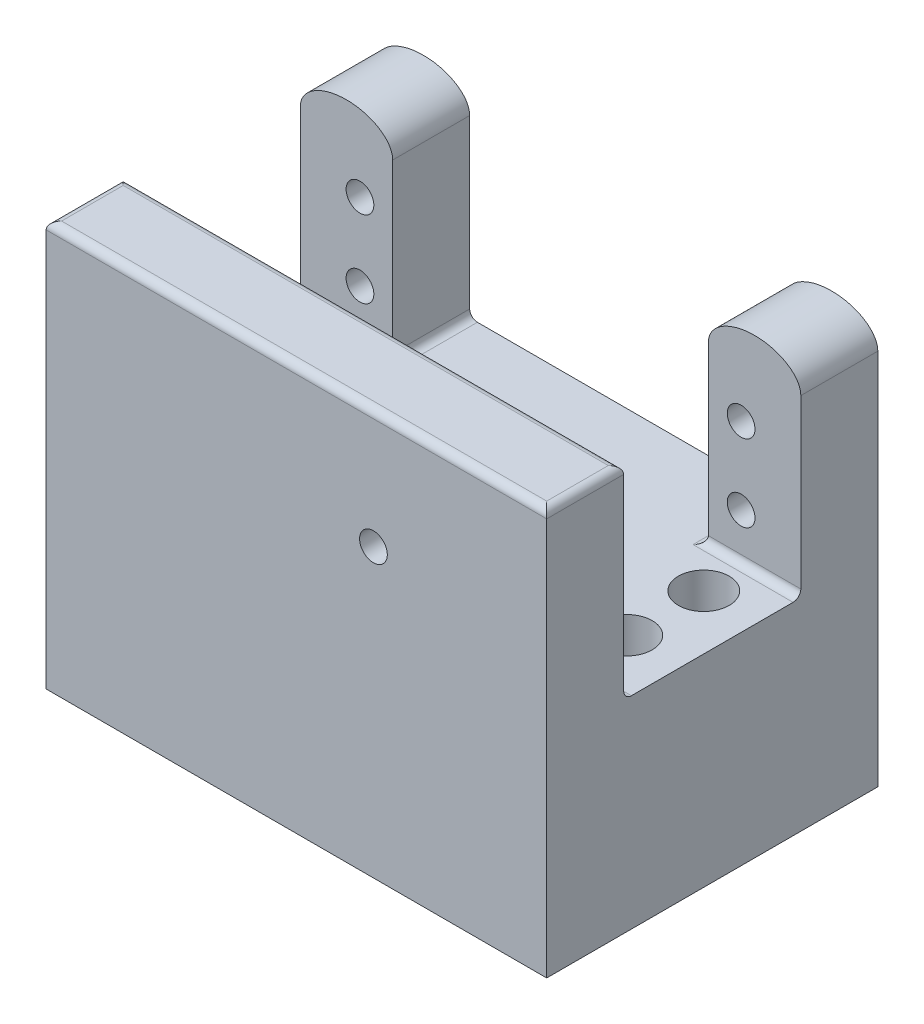
ISO-10303-21;
HEADER;
FILE_DESCRIPTION(('STEP AP214'),'2;1');
FILE_NAME('part.step','',(''),(''),'','','');
FILE_SCHEMA(('AUTOMOTIVE_DESIGN { 1 0 10303 214 1 1 1 1 }'));
ENDSEC;
DATA;
#1=APPLICATION_CONTEXT('core data for automotive mechanical design processes');
#2=APPLICATION_PROTOCOL_DEFINITION('international standard','automotive_design',2000,#1);
#3=PRODUCT_CONTEXT('',#1,'mechanical');
#4=PRODUCT('Part','Part','',(#3));
#5=PRODUCT_RELATED_PRODUCT_CATEGORY('part','',(#4));
#6=PRODUCT_DEFINITION_FORMATION('','',#4);
#7=PRODUCT_DEFINITION_CONTEXT('part definition',#1,'design');
#8=PRODUCT_DEFINITION('design','',#6,#7);
#9=PRODUCT_DEFINITION_SHAPE('','',#8);
#10=(LENGTH_UNIT() NAMED_UNIT(*) SI_UNIT(.MILLI.,.METRE.));
#11=(NAMED_UNIT(*) PLANE_ANGLE_UNIT() SI_UNIT($,.RADIAN.));
#12=(NAMED_UNIT(*) SI_UNIT($,.STERADIAN.) SOLID_ANGLE_UNIT());
#13=UNCERTAINTY_MEASURE_WITH_UNIT(LENGTH_MEASURE(1.E-05),#10,'distance_accuracy_value','');
#14=(GEOMETRIC_REPRESENTATION_CONTEXT(3) GLOBAL_UNCERTAINTY_ASSIGNED_CONTEXT((#13)) GLOBAL_UNIT_ASSIGNED_CONTEXT((#10,
#11,#12)) REPRESENTATION_CONTEXT('',''));
#15=CARTESIAN_POINT('',(0.,0.,0.));
#16=DIRECTION('',(0.,0.,1.));
#17=DIRECTION('',(1.,0.,0.));
#18=AXIS2_PLACEMENT_3D('',#15,#16,#17);
#19=CARTESIAN_POINT('',(0.,0.,33.));
#20=DIRECTION('',(0.,0.,1.));
#21=DIRECTION('',(1.,0.,0.));
#22=AXIS2_PLACEMENT_3D('',#19,#20,#21);
#23=PLANE('',#22);
#24=CARTESIAN_POINT('',(-16.5,2.55301226726425,33.));
#25=DIRECTION('',(0.,0.,1.));
#26=DIRECTION('',(1.,0.,0.));
#27=AXIS2_PLACEMENT_3D('',#24,#25,#26);
#28=CIRCLE('',#27,1.79999999999999);
#29=CARTESIAN_POINT('',(-14.7,2.55301226726425,33.));
#30=VERTEX_POINT('',#29);
#31=EDGE_CURVE('E404',#30,#30,#28,.T.);
#32=ORIENTED_EDGE('',*,*,#31,.T.);
#33=EDGE_LOOP('',(#32));
#34=FACE_BOUND('',#33,.T.);
#35=DIRECTION('',(0.,-1.,0.));
#36=VECTOR('',#35,1.);
#37=CARTESIAN_POINT('',(-59.,-20.6976744186047,33.));
#38=LINE('',#37,#36);
#39=CARTESIAN_POINT('',(-59.,16.9392946847438,33.));
#40=VERTEX_POINT('',#39);
#41=CARTESIAN_POINT('',(-59.,-7.44767441860465,33.));
#42=VERTEX_POINT('',#41);
#43=EDGE_CURVE('E419',#40,#42,#38,.T.);
#44=ORIENTED_EDGE('',*,*,#43,.F.);
#45=DIRECTION('',(-1.,0.,0.));
#46=VECTOR('',#45,1.);
#47=CARTESIAN_POINT('',(0.,16.9392946847438,33.));
#48=LINE('',#47,#46);
#49=CARTESIAN_POINT('',(6.00000000000001,16.9392946847438,33.));
#50=VERTEX_POINT('',#49);
#51=EDGE_CURVE('E330',#40,#50,#48,.F.);
#52=ORIENTED_EDGE('',*,*,#51,.T.);
#53=DIRECTION('',(0.,1.,0.));
#54=VECTOR('',#53,1.);
#55=CARTESIAN_POINT('',(6.00000000000001,-20.6976744186046,33.));
#56=LINE('',#55,#54);
#57=CARTESIAN_POINT('',(6.00000000000001,-7.44767441860465,33.));
#58=VERTEX_POINT('',#57);
#59=EDGE_CURVE('E441',#58,#50,#56,.T.);
#60=ORIENTED_EDGE('',*,*,#59,.F.);
#61=DIRECTION('',(1.,0.,0.));
#62=VECTOR('',#61,1.);
#63=CARTESIAN_POINT('',(0.,-7.44767441860465,33.));
#64=LINE('',#63,#62);
#65=EDGE_CURVE('E328',#58,#42,#64,.F.);
#66=ORIENTED_EDGE('',*,*,#65,.T.);
#67=EDGE_LOOP('',(#44,#52,#60,#66));
#68=FACE_BOUND('',#67,.T.);
#69=ADVANCED_FACE('F40',(#34,#68),#23,.F.);
#70=CARTESIAN_POINT('',(-6.,14.3023255813954,10.));
#71=DIRECTION('',(1.,0.,0.));
#72=DIRECTION('',(0.,1.,0.));
#73=AXIS2_PLACEMENT_3D('',#70,#71,#72);
#74=PLANE('',#73);
#75=DIRECTION('',(0.,-1.,0.));
#76=VECTOR('',#75,1.);
#77=CARTESIAN_POINT('',(-6.,14.3023255813954,0.));
#78=LINE('',#77,#76);
#79=CARTESIAN_POINT('',(-6.,14.3023255813954,0.));
#80=VERTEX_POINT('',#79);
#81=CARTESIAN_POINT('',(-6.,-7.44767441860465,0.));
#82=VERTEX_POINT('',#81);
#83=EDGE_CURVE('E308',#80,#82,#78,.T.);
#84=ORIENTED_EDGE('',*,*,#83,.T.);
#85=DIRECTION('',(0.,0.,1.));
#86=VECTOR('',#85,1.);
#87=CARTESIAN_POINT('',(-6.,-7.44767441860465,10.));
#88=LINE('',#87,#86);
#89=CARTESIAN_POINT('',(-6.,-7.44767441860465,10.));
#90=VERTEX_POINT('',#89);
#91=EDGE_CURVE('E353',#82,#90,#88,.T.);
#92=ORIENTED_EDGE('',*,*,#91,.T.);
#93=DIRECTION('',(0.,-1.,0.));
#94=VECTOR('',#93,1.);
#95=CARTESIAN_POINT('',(-6.,14.3023255813954,10.));
#96=LINE('',#95,#94);
#97=CARTESIAN_POINT('',(-6.,14.3023255813954,10.));
#98=VERTEX_POINT('',#97);
#99=EDGE_CURVE('E297',#98,#90,#96,.T.);
#100=ORIENTED_EDGE('',*,*,#99,.F.);
#101=DIRECTION('',(0.,0.,-1.));
#102=VECTOR('',#101,1.);
#103=CARTESIAN_POINT('',(-6.,14.3023255813954,10.));
#104=LINE('',#103,#102);
#105=EDGE_CURVE('E313',#98,#80,#104,.T.);
#106=ORIENTED_EDGE('',*,*,#105,.T.);
#107=EDGE_LOOP('',(#84,#92,#100,#106));
#108=FACE_BOUND('',#107,.T.);
#109=ADVANCED_FACE('F254',(#108),#74,.F.);
#110=CARTESIAN_POINT('',(-47.,-20.6976744186046,33.));
#111=DIRECTION('',(-1.,0.,0.));
#112=DIRECTION('',(0.,0.,1.));
#113=AXIS2_PLACEMENT_3D('',#110,#111,#112);
#114=PLANE('',#113);
#115=DIRECTION('',(0.,-1.,0.));
#116=VECTOR('',#115,1.);
#117=CARTESIAN_POINT('',(-47.,14.3023255813954,10.));
#118=LINE('',#117,#116);
#119=CARTESIAN_POINT('',(-47.,14.3023255813954,10.));
#120=VERTEX_POINT('',#119);
#121=CARTESIAN_POINT('',(-47.,-7.44767441860465,10.));
#122=VERTEX_POINT('',#121);
#123=EDGE_CURVE('E493',#120,#122,#118,.T.);
#124=ORIENTED_EDGE('',*,*,#123,.T.);
#125=DIRECTION('',(0.,0.,1.));
#126=VECTOR('',#125,1.);
#127=CARTESIAN_POINT('',(-47.,-7.44767441860465,33.));
#128=LINE('',#127,#126);
#129=CARTESIAN_POINT('',(-47.,-7.44767441860465,0.));
#130=VERTEX_POINT('',#129);
#131=EDGE_CURVE('E57',#122,#130,#128,.F.);
#132=ORIENTED_EDGE('',*,*,#131,.T.);
#133=DIRECTION('',(0.,-1.,0.));
#134=VECTOR('',#133,1.);
#135=CARTESIAN_POINT('',(-47.,14.3023255813954,0.));
#136=LINE('',#135,#134);
#137=CARTESIAN_POINT('',(-47.,14.3023255813954,0.));
#138=VERTEX_POINT('',#137);
#139=EDGE_CURVE('E179',#138,#130,#136,.T.);
#140=ORIENTED_EDGE('',*,*,#139,.F.);
#141=DIRECTION('',(0.,0.,-1.));
#142=VECTOR('',#141,1.);
#143=CARTESIAN_POINT('',(-47.,14.3023255813954,10.));
#144=LINE('',#143,#142);
#145=EDGE_CURVE('E489',#120,#138,#144,.T.);
#146=ORIENTED_EDGE('',*,*,#145,.F.);
#147=EDGE_LOOP('',(#124,#132,#140,#146));
#148=FACE_BOUND('',#147,.T.);
#149=ADVANCED_FACE('F250',(#148),#114,.F.);
#150=CARTESIAN_POINT('',(0.,14.3023255813954,10.));
#151=DIRECTION('',(0.,0.,1.));
#152=DIRECTION('',(1.,0.,0.));
#153=AXIS2_PLACEMENT_3D('',#150,#151,#152);
#154=PLANE('',#153);
#155=CARTESIAN_POINT('',(-1.75,7.55218083966562,10.));
#156=DIRECTION('',(0.,0.,1.));
#157=DIRECTION('',(1.,0.,0.));
#158=AXIS2_PLACEMENT_3D('',#155,#156,#157);
#159=CIRCLE('',#158,1.8);
#160=CARTESIAN_POINT('',(0.0499999999999982,7.55218083966562,10.));
#161=VERTEX_POINT('',#160);
#162=EDGE_CURVE('E214',#161,#161,#159,.F.);
#163=ORIENTED_EDGE('',*,*,#162,.T.);
#164=EDGE_LOOP('',(#163));
#165=FACE_BOUND('',#164,.T.);
#166=CARTESIAN_POINT('',(-1.75,-2.44781916033438,10.));
#167=DIRECTION('',(0.,0.,1.));
#168=DIRECTION('',(1.,0.,0.));
#169=AXIS2_PLACEMENT_3D('',#166,#167,#168);
#170=CIRCLE('',#169,1.8);
#171=CARTESIAN_POINT('',(0.0499999999999982,-2.44781916033438,10.));
#172=VERTEX_POINT('',#171);
#173=EDGE_CURVE('E220',#172,#172,#170,.F.);
#174=ORIENTED_EDGE('',*,*,#173,.T.);
#175=EDGE_LOOP('',(#174));
#176=FACE_BOUND('',#175,.T.);
#177=ORIENTED_EDGE('',*,*,#99,.T.);
#178=DIRECTION('',(1.,0.,0.));
#179=VECTOR('',#178,1.);
#180=CARTESIAN_POINT('',(6.,-7.44767441860465,10.));
#181=LINE('',#180,#179);
#182=CARTESIAN_POINT('',(6.,-7.44767441860465,10.));
#183=VERTEX_POINT('',#182);
#184=EDGE_CURVE('E350',#90,#183,#181,.T.);
#185=ORIENTED_EDGE('',*,*,#184,.T.);
#186=DIRECTION('',(0.,1.,0.));
#187=VECTOR('',#186,1.);
#188=CARTESIAN_POINT('',(6.,14.3023255813954,10.));
#189=LINE('',#188,#187);
#190=CARTESIAN_POINT('',(6.,14.3023255813954,10.));
#191=VERTEX_POINT('',#190);
#192=EDGE_CURVE('E302',#183,#191,#189,.T.);
#193=ORIENTED_EDGE('',*,*,#192,.T.);
#194=CARTESIAN_POINT('',(0.,14.3023255813954,10.));
#195=DIRECTION('',(0.,0.,1.));
#196=DIRECTION('',(1.,0.,0.));
#197=AXIS2_PLACEMENT_3D('',#194,#195,#196);
#198=ELLIPSE('',#197,6.,3.77568003702185);
#199=EDGE_CURVE('E292',#191,#98,#198,.T.);
#200=ORIENTED_EDGE('',*,*,#199,.T.);
#201=EDGE_LOOP('',(#177,#185,#193,#200));
#202=FACE_BOUND('',#201,.T.);
#203=ADVANCED_FACE('F253',(#165,#176,#202),#154,.T.);
#204=DIRECTION('',(0.,0.,-1.));
#205=VECTOR('',#204,1.);
#206=SURFACE_OF_LINEAR_EXTRUSION('',#198,#205);
#207=CARTESIAN_POINT('',(0.,14.3023255813954,0.));
#208=DIRECTION('',(0.,0.,1.));
#209=DIRECTION('',(1.,0.,0.));
#210=AXIS2_PLACEMENT_3D('',#207,#208,#209);
#211=ELLIPSE('',#210,6.,3.77568003702185);
#212=CARTESIAN_POINT('',(6.,14.3023255813954,0.));
#213=VERTEX_POINT('',#212);
#214=EDGE_CURVE('E305',#213,#80,#211,.T.);
#215=ORIENTED_EDGE('',*,*,#214,.T.);
#216=ORIENTED_EDGE('',*,*,#105,.F.);
#217=ORIENTED_EDGE('',*,*,#199,.F.);
#218=DIRECTION('',(0.,0.,-1.));
#219=VECTOR('',#218,1.);
#220=CARTESIAN_POINT('',(6.,14.3023255813954,10.));
#221=LINE('',#220,#219);
#222=EDGE_CURVE('E304',#191,#213,#221,.T.);
#223=ORIENTED_EDGE('',*,*,#222,.T.);
#224=EDGE_LOOP('',(#215,#216,#217,#223));
#225=FACE_BOUND('',#224,.T.);
#226=ADVANCED_FACE('F274',(#225),#206,.F.);
#227=CARTESIAN_POINT('',(6.,14.3023255813954,10.));
#228=DIRECTION('',(-1.,0.,0.));
#229=DIRECTION('',(0.,-1.,0.));
#230=AXIS2_PLACEMENT_3D('',#227,#228,#229);
#231=PLANE('',#230);
#232=ORIENTED_EDGE('',*,*,#59,.T.);
#233=DIRECTION('',(0.,0.,-1.));
#234=VECTOR('',#233,1.);
#235=CARTESIAN_POINT('',(6.,16.9392946847438,10.));
#236=LINE('',#235,#234);
#237=CARTESIAN_POINT('',(6.00000000000001,16.9392946847438,43.));
#238=VERTEX_POINT('',#237);
#239=EDGE_CURVE('E332',#50,#238,#236,.F.);
#240=ORIENTED_EDGE('',*,*,#239,.T.);
#241=DIRECTION('',(0.,1.,0.));
#242=VECTOR('',#241,1.);
#243=CARTESIAN_POINT('',(6.00000000000001,-20.6976744186046,43.));
#244=LINE('',#243,#242);
#245=CARTESIAN_POINT('',(6.00000000000001,-34.6976744186046,43.));
#246=VERTEX_POINT('',#245);
#247=EDGE_CURVE('E415',#246,#238,#244,.T.);
#248=ORIENTED_EDGE('',*,*,#247,.F.);
#249=DIRECTION('',(0.,0.,1.));
#250=VECTOR('',#249,1.);
#251=CARTESIAN_POINT('',(6.00000000000001,-34.6976744186046,43.));
#252=LINE('',#251,#250);
#253=CARTESIAN_POINT('',(6.00000000000001,-34.6976744186046,0.));
#254=VERTEX_POINT('',#253);
#255=EDGE_CURVE('E191',#254,#246,#252,.T.);
#256=ORIENTED_EDGE('',*,*,#255,.F.);
#257=DIRECTION('',(0.,1.,0.));
#258=VECTOR('',#257,1.);
#259=CARTESIAN_POINT('',(6.,14.3023255813954,0.));
#260=LINE('',#259,#258);
#261=EDGE_CURVE('E187',#254,#213,#260,.T.);
#262=ORIENTED_EDGE('',*,*,#261,.T.);
#263=ORIENTED_EDGE('',*,*,#222,.F.);
#264=ORIENTED_EDGE('',*,*,#192,.F.);
#265=CARTESIAN_POINT('',(6.,-7.44767441860465,11.));
#266=DIRECTION('',(-1.,0.,0.));
#267=DIRECTION('',(0.,-1.,0.));
#268=AXIS2_PLACEMENT_3D('',#265,#266,#267);
#269=CIRCLE('',#268,1.);
#270=CARTESIAN_POINT('',(6.00000000000001,-8.44767441860465,11.));
#271=VERTEX_POINT('',#270);
#272=EDGE_CURVE('E358',#183,#271,#269,.T.);
#273=ORIENTED_EDGE('',*,*,#272,.T.);
#274=DIRECTION('',(0.,0.,-1.));
#275=VECTOR('',#274,1.);
#276=CARTESIAN_POINT('',(6.00000000000001,-8.44767441860465,33.));
#277=LINE('',#276,#275);
#278=CARTESIAN_POINT('',(6.00000000000001,-8.44767441860465,32.));
#279=VERTEX_POINT('',#278);
#280=EDGE_CURVE('E298',#279,#271,#277,.T.);
#281=ORIENTED_EDGE('',*,*,#280,.F.);
#282=CARTESIAN_POINT('',(6.00000000000001,-7.44767441860465,32.));
#283=DIRECTION('',(-1.,0.,0.));
#284=DIRECTION('',(0.,-1.,0.));
#285=AXIS2_PLACEMENT_3D('',#282,#283,#284);
#286=CIRCLE('',#285,1.);
#287=EDGE_CURVE('E49',#279,#58,#286,.T.);
#288=ORIENTED_EDGE('',*,*,#287,.T.);
#289=EDGE_LOOP('',(#232,#240,#248,#256,#262,#263,#264,#273,#281,#288));
#290=FACE_BOUND('',#289,.T.);
#291=ADVANCED_FACE('F278',(#290),#231,.F.);
#292=CARTESIAN_POINT('',(0.,14.3023255813954,0.));
#293=DIRECTION('',(0.,0.,1.));
#294=DIRECTION('',(1.,0.,0.));
#295=AXIS2_PLACEMENT_3D('',#292,#293,#294);
#296=PLANE('',#295);
#297=CARTESIAN_POINT('',(-1.75,7.55218083966562,0.));
#298=DIRECTION('',(0.,0.,-1.));
#299=DIRECTION('',(-1.,0.,0.));
#300=AXIS2_PLACEMENT_3D('',#297,#298,#299);
#301=CIRCLE('',#300,1.8);
#302=CARTESIAN_POINT('',(-3.55,7.55218083966562,0.));
#303=VERTEX_POINT('',#302);
#304=EDGE_CURVE('E211',#303,#303,#301,.T.);
#305=ORIENTED_EDGE('',*,*,#304,.F.);
#306=EDGE_LOOP('',(#305));
#307=FACE_BOUND('',#306,.T.);
#308=CARTESIAN_POINT('',(-1.75,-2.44781916033438,0.));
#309=DIRECTION('',(0.,0.,-1.));
#310=DIRECTION('',(-1.,0.,0.));
#311=AXIS2_PLACEMENT_3D('',#308,#309,#310);
#312=CIRCLE('',#311,1.8);
#313=CARTESIAN_POINT('',(-3.55,-2.44781916033438,0.));
#314=VERTEX_POINT('',#313);
#315=EDGE_CURVE('E217',#314,#314,#312,.T.);
#316=ORIENTED_EDGE('',*,*,#315,.F.);
#317=EDGE_LOOP('',(#316));
#318=FACE_BOUND('',#317,.T.);
#319=ORIENTED_EDGE('',*,*,#214,.F.);
#320=ORIENTED_EDGE('',*,*,#261,.F.);
#321=DIRECTION('',(1.,0.,0.));
#322=VECTOR('',#321,1.);
#323=CARTESIAN_POINT('',(-59.,-34.6976744186046,0.));
#324=LINE('',#323,#322);
#325=CARTESIAN_POINT('',(-59.,-34.6976744186046,0.));
#326=VERTEX_POINT('',#325);
#327=EDGE_CURVE('E183',#326,#254,#324,.T.);
#328=ORIENTED_EDGE('',*,*,#327,.F.);
#329=DIRECTION('',(0.,1.,0.));
#330=VECTOR('',#329,1.);
#331=CARTESIAN_POINT('',(-59.,14.3023255813954,0.));
#332=LINE('',#331,#330);
#333=CARTESIAN_POINT('',(-59.,14.3023255813954,0.));
#334=VERTEX_POINT('',#333);
#335=EDGE_CURVE('E169',#326,#334,#332,.T.);
#336=ORIENTED_EDGE('',*,*,#335,.T.);
#337=CARTESIAN_POINT('',(-53.,14.3023255813954,0.));
#338=DIRECTION('',(0.,0.,-1.));
#339=DIRECTION('',(-1.,0.,0.));
#340=AXIS2_PLACEMENT_3D('',#337,#338,#339);
#341=ELLIPSE('',#340,6.,3.77568003702185);
#342=EDGE_CURVE('E180',#334,#138,#341,.T.);
#343=ORIENTED_EDGE('',*,*,#342,.T.);
#344=ORIENTED_EDGE('',*,*,#139,.T.);
#345=CARTESIAN_POINT('',(-46.,-7.44767441860465,0.));
#346=DIRECTION('',(0.,0.,1.));
#347=DIRECTION('',(1.,0.,0.));
#348=AXIS2_PLACEMENT_3D('',#345,#346,#347);
#349=CIRCLE('',#348,1.);
#350=CARTESIAN_POINT('',(-46.,-8.44767441860465,0.));
#351=VERTEX_POINT('',#350);
#352=EDGE_CURVE('E361',#130,#351,#349,.T.);
#353=ORIENTED_EDGE('',*,*,#352,.T.);
#354=DIRECTION('',(-1.,0.,0.));
#355=VECTOR('',#354,1.);
#356=CARTESIAN_POINT('',(-5.99999999999999,-8.44767441860465,0.));
#357=LINE('',#356,#355);
#358=CARTESIAN_POINT('',(-7.,-8.44767441860465,0.));
#359=VERTEX_POINT('',#358);
#360=EDGE_CURVE('E208',#359,#351,#357,.T.);
#361=ORIENTED_EDGE('',*,*,#360,.F.);
#362=CARTESIAN_POINT('',(-7.,-7.44767441860465,0.));
#363=DIRECTION('',(0.,0.,1.));
#364=DIRECTION('',(1.,0.,0.));
#365=AXIS2_PLACEMENT_3D('',#362,#363,#364);
#366=CIRCLE('',#365,1.);
#367=EDGE_CURVE('E65',#359,#82,#366,.T.);
#368=ORIENTED_EDGE('',*,*,#367,.T.);
#369=ORIENTED_EDGE('',*,*,#83,.F.);
#370=EDGE_LOOP('',(#319,#320,#328,#336,#343,#344,#353,#361,#368,#369));
#371=FACE_BOUND('',#370,.T.);
#372=CARTESIAN_POINT('',(-51.25,8.00000000000001,0.));
#373=DIRECTION('',(0.,0.,-1.));
#374=DIRECTION('',(-1.,0.,0.));
#375=AXIS2_PLACEMENT_3D('',#372,#373,#374);
#376=CIRCLE('',#375,1.8);
#377=CARTESIAN_POINT('',(-53.05,8.00000000000001,0.));
#378=VERTEX_POINT('',#377);
#379=EDGE_CURVE('E223',#378,#378,#376,.T.);
#380=ORIENTED_EDGE('',*,*,#379,.F.);
#381=EDGE_LOOP('',(#380));
#382=FACE_BOUND('',#381,.T.);
#383=CARTESIAN_POINT('',(-51.25,-1.99999999999999,0.));
#384=DIRECTION('',(0.,0.,-1.));
#385=DIRECTION('',(-1.,0.,0.));
#386=AXIS2_PLACEMENT_3D('',#383,#384,#385);
#387=CIRCLE('',#386,1.8);
#388=CARTESIAN_POINT('',(-53.05,-1.99999999999999,0.));
#389=VERTEX_POINT('',#388);
#390=EDGE_CURVE('E229',#389,#389,#387,.T.);
#391=ORIENTED_EDGE('',*,*,#390,.F.);
#392=EDGE_LOOP('',(#391));
#393=FACE_BOUND('',#392,.T.);
#394=ADVANCED_FACE('F185',(#307,#318,#371,#382,#393),#296,.F.);
#395=CARTESIAN_POINT('',(-5.99999999999999,-8.44767441860465,33.));
#396=DIRECTION('',(0.,1.,0.));
#397=DIRECTION('',(0.,0.,1.));
#398=AXIS2_PLACEMENT_3D('',#395,#396,#397);
#399=PLANE('',#398);
#400=CARTESIAN_POINT('',(-1.09999999999998,-8.44767441860465,15.5));
#401=DIRECTION('',(0.,1.,0.));
#402=DIRECTION('',(0.,0.,1.));
#403=AXIS2_PLACEMENT_3D('',#400,#401,#402);
#404=CIRCLE('',#403,3.29999999999999);
#405=CARTESIAN_POINT('',(-1.09999999999998,-8.44767441860465,18.8));
#406=VERTEX_POINT('',#405);
#407=EDGE_CURVE('E398',#406,#406,#404,.T.);
#408=ORIENTED_EDGE('',*,*,#407,.F.);
#409=EDGE_LOOP('',(#408));
#410=FACE_BOUND('',#409,.T.);
#411=CARTESIAN_POINT('',(-1.09999999999998,-8.44767441860465,25.5));
#412=DIRECTION('',(0.,1.,0.));
#413=DIRECTION('',(0.,0.,1.));
#414=AXIS2_PLACEMENT_3D('',#411,#412,#413);
#415=CIRCLE('',#414,3.29999999999999);
#416=CARTESIAN_POINT('',(-1.09999999999998,-8.44767441860465,28.8));
#417=VERTEX_POINT('',#416);
#418=EDGE_CURVE('E390',#417,#417,#415,.T.);
#419=ORIENTED_EDGE('',*,*,#418,.F.);
#420=EDGE_LOOP('',(#419));
#421=FACE_BOUND('',#420,.T.);
#422=CARTESIAN_POINT('',(-51.9,-8.44767441860465,15.5));
#423=DIRECTION('',(0.,1.,0.));
#424=DIRECTION('',(0.,0.,1.));
#425=AXIS2_PLACEMENT_3D('',#422,#423,#424);
#426=CIRCLE('',#425,3.29999999999999);
#427=CARTESIAN_POINT('',(-51.9,-8.44767441860465,18.8));
#428=VERTEX_POINT('',#427);
#429=EDGE_CURVE('E382',#428,#428,#426,.T.);
#430=ORIENTED_EDGE('',*,*,#429,.F.);
#431=EDGE_LOOP('',(#430));
#432=FACE_BOUND('',#431,.T.);
#433=CARTESIAN_POINT('',(-51.9,-8.44767441860465,25.5));
#434=DIRECTION('',(0.,1.,0.));
#435=DIRECTION('',(0.,0.,1.));
#436=AXIS2_PLACEMENT_3D('',#433,#434,#435);
#437=CIRCLE('',#436,3.29999999999999);
#438=CARTESIAN_POINT('',(-51.9,-8.44767441860465,28.8));
#439=VERTEX_POINT('',#438);
#440=EDGE_CURVE('E44',#439,#439,#437,.T.);
#441=ORIENTED_EDGE('',*,*,#440,.F.);
#442=EDGE_LOOP('',(#441));
#443=FACE_BOUND('',#442,.T.);
#444=ORIENTED_EDGE('',*,*,#280,.T.);
#445=DIRECTION('',(1.,0.,0.));
#446=VECTOR('',#445,1.);
#447=CARTESIAN_POINT('',(-5.99999999999999,-8.44767441860465,11.));
#448=LINE('',#447,#446);
#449=CARTESIAN_POINT('',(-7.,-8.44767441860465,11.));
#450=VERTEX_POINT('',#449);
#451=EDGE_CURVE('E346',#271,#450,#448,.F.);
#452=ORIENTED_EDGE('',*,*,#451,.T.);
#453=DIRECTION('',(0.,0.,1.));
#454=VECTOR('',#453,1.);
#455=CARTESIAN_POINT('',(-7.,-8.44767441860465,33.));
#456=LINE('',#455,#454);
#457=EDGE_CURVE('E344',#450,#359,#456,.F.);
#458=ORIENTED_EDGE('',*,*,#457,.T.);
#459=ORIENTED_EDGE('',*,*,#360,.T.);
#460=DIRECTION('',(0.,0.,1.));
#461=VECTOR('',#460,1.);
#462=CARTESIAN_POINT('',(-46.,-8.44767441860465,33.));
#463=LINE('',#462,#461);
#464=CARTESIAN_POINT('',(-46.,-8.44767441860465,11.));
#465=VERTEX_POINT('',#464);
#466=EDGE_CURVE('E339',#351,#465,#463,.T.);
#467=ORIENTED_EDGE('',*,*,#466,.T.);
#468=DIRECTION('',(-1.,0.,0.));
#469=VECTOR('',#468,1.);
#470=CARTESIAN_POINT('',(-59.,-8.44767441860465,11.));
#471=LINE('',#470,#469);
#472=CARTESIAN_POINT('',(-59.,-8.44767441860465,11.));
#473=VERTEX_POINT('',#472);
#474=EDGE_CURVE('E341',#465,#473,#471,.T.);
#475=ORIENTED_EDGE('',*,*,#474,.T.);
#476=DIRECTION('',(0.,0.,-1.));
#477=VECTOR('',#476,1.);
#478=CARTESIAN_POINT('',(-59.,-8.44767441860465,33.));
#479=LINE('',#478,#477);
#480=CARTESIAN_POINT('',(-59.,-8.44767441860465,32.));
#481=VERTEX_POINT('',#480);
#482=EDGE_CURVE('E487',#481,#473,#479,.T.);
#483=ORIENTED_EDGE('',*,*,#482,.F.);
#484=DIRECTION('',(1.,0.,0.));
#485=VECTOR('',#484,1.);
#486=CARTESIAN_POINT('',(-5.99999999999999,-8.44767441860465,32.));
#487=LINE('',#486,#485);
#488=EDGE_CURVE('E336',#481,#279,#487,.T.);
#489=ORIENTED_EDGE('',*,*,#488,.T.);
#490=EDGE_LOOP('',(#444,#452,#458,#459,#467,#475,#483,#489));
#491=FACE_BOUND('',#490,.T.);
#492=ADVANCED_FACE('F267',(#410,#421,#432,#443,#491),#399,.T.);
#493=CARTESIAN_POINT('',(6.00000000000001,17.9392946847438,43.));
#494=DIRECTION('',(0.,-1.,0.));
#495=DIRECTION('',(1.,0.,0.));
#496=AXIS2_PLACEMENT_3D('',#493,#494,#495);
#497=PLANE('',#496);
#498=DIRECTION('',(-1.,0.,0.));
#499=VECTOR('',#498,1.);
#500=CARTESIAN_POINT('',(6.00000000000001,17.9392946847438,42.));
#501=LINE('',#500,#499);
#502=CARTESIAN_POINT('',(-58.,17.9392946847438,42.));
#503=VERTEX_POINT('',#502);
#504=CARTESIAN_POINT('',(5.,17.9392946847438,42.));
#505=VERTEX_POINT('',#504);
#506=EDGE_CURVE('E323',#503,#505,#501,.F.);
#507=ORIENTED_EDGE('',*,*,#506,.T.);
#508=DIRECTION('',(0.,0.,-1.));
#509=VECTOR('',#508,1.);
#510=CARTESIAN_POINT('',(5.,17.9392946847438,43.));
#511=LINE('',#510,#509);
#512=CARTESIAN_POINT('',(5.,17.9392946847438,34.));
#513=VERTEX_POINT('',#512);
#514=EDGE_CURVE('E326',#505,#513,#511,.T.);
#515=ORIENTED_EDGE('',*,*,#514,.T.);
#516=DIRECTION('',(-1.,0.,0.));
#517=VECTOR('',#516,1.);
#518=CARTESIAN_POINT('',(6.00000000000001,17.9392946847438,34.));
#519=LINE('',#518,#517);
#520=CARTESIAN_POINT('',(-58.,17.9392946847438,34.));
#521=VERTEX_POINT('',#520);
#522=EDGE_CURVE('E321',#513,#521,#519,.T.);
#523=ORIENTED_EDGE('',*,*,#522,.T.);
#524=DIRECTION('',(0.,0.,-1.));
#525=VECTOR('',#524,1.);
#526=CARTESIAN_POINT('',(-58.,17.9392946847438,43.));
#527=LINE('',#526,#525);
#528=EDGE_CURVE('E319',#521,#503,#527,.F.);
#529=ORIENTED_EDGE('',*,*,#528,.T.);
#530=EDGE_LOOP('',(#507,#515,#523,#529));
#531=FACE_BOUND('',#530,.T.);
#532=ADVANCED_FACE('F264',(#531),#497,.F.);
#533=CARTESIAN_POINT('',(-59.,-20.6976744186047,43.));
#534=DIRECTION('',(1.,0.,0.));
#535=DIRECTION('',(0.,0.,-1.));
#536=AXIS2_PLACEMENT_3D('',#533,#534,#535);
#537=PLANE('',#536);
#538=DIRECTION('',(0.,-1.,0.));
#539=VECTOR('',#538,1.);
#540=CARTESIAN_POINT('',(-59.,-20.6976744186047,43.));
#541=LINE('',#540,#539);
#542=CARTESIAN_POINT('',(-59.,16.9392946847438,43.));
#543=VERTEX_POINT('',#542);
#544=CARTESIAN_POINT('',(-59.,-34.6976744186046,43.));
#545=VERTEX_POINT('',#544);
#546=EDGE_CURVE('E418',#543,#545,#541,.T.);
#547=ORIENTED_EDGE('',*,*,#546,.F.);
#548=DIRECTION('',(0.,0.,-1.));
#549=VECTOR('',#548,1.);
#550=CARTESIAN_POINT('',(-59.,16.9392946847438,43.));
#551=LINE('',#550,#549);
#552=EDGE_CURVE('E334',#543,#40,#551,.T.);
#553=ORIENTED_EDGE('',*,*,#552,.T.);
#554=ORIENTED_EDGE('',*,*,#43,.T.);
#555=CARTESIAN_POINT('',(-59.,-7.44767441860465,32.));
#556=DIRECTION('',(1.,0.,0.));
#557=DIRECTION('',(0.,0.,-1.));
#558=AXIS2_PLACEMENT_3D('',#555,#556,#557);
#559=CIRCLE('',#558,1.);
#560=EDGE_CURVE('E11',#42,#481,#559,.T.);
#561=ORIENTED_EDGE('',*,*,#560,.T.);
#562=ORIENTED_EDGE('',*,*,#482,.T.);
#563=CARTESIAN_POINT('',(-59.,-7.44767441860465,11.));
#564=DIRECTION('',(1.,0.,0.));
#565=DIRECTION('',(0.,0.,-1.));
#566=AXIS2_PLACEMENT_3D('',#563,#564,#565);
#567=CIRCLE('',#566,1.);
#568=CARTESIAN_POINT('',(-59.,-7.44767441860465,10.));
#569=VERTEX_POINT('',#568);
#570=EDGE_CURVE('E356',#473,#569,#567,.T.);
#571=ORIENTED_EDGE('',*,*,#570,.T.);
#572=DIRECTION('',(0.,1.,0.));
#573=VECTOR('',#572,1.);
#574=CARTESIAN_POINT('',(-59.,14.3023255813954,10.));
#575=LINE('',#574,#573);
#576=CARTESIAN_POINT('',(-59.,14.3023255813954,10.));
#577=VERTEX_POINT('',#576);
#578=EDGE_CURVE('E239',#569,#577,#575,.T.);
#579=ORIENTED_EDGE('',*,*,#578,.T.);
#580=DIRECTION('',(0.,0.,-1.));
#581=VECTOR('',#580,1.);
#582=CARTESIAN_POINT('',(-59.,14.3023255813954,10.));
#583=LINE('',#582,#581);
#584=EDGE_CURVE('E176',#577,#334,#583,.T.);
#585=ORIENTED_EDGE('',*,*,#584,.T.);
#586=ORIENTED_EDGE('',*,*,#335,.F.);
#587=DIRECTION('',(0.,0.,-1.));
#588=VECTOR('',#587,1.);
#589=CARTESIAN_POINT('',(-59.,-34.6976744186046,43.));
#590=LINE('',#589,#588);
#591=EDGE_CURVE('E174',#545,#326,#590,.T.);
#592=ORIENTED_EDGE('',*,*,#591,.F.);
#593=EDGE_LOOP('',(#547,#553,#554,#561,#562,#571,#579,#585,#586,#592));
#594=FACE_BOUND('',#593,.T.);
#595=ADVANCED_FACE('F172',(#594),#537,.F.);
#596=CARTESIAN_POINT('',(0.,0.,43.));
#597=DIRECTION('',(0.,0.,1.));
#598=DIRECTION('',(1.,0.,0.));
#599=AXIS2_PLACEMENT_3D('',#596,#597,#598);
#600=PLANE('',#599);
#601=CARTESIAN_POINT('',(-16.5,2.55301226726425,43.));
#602=DIRECTION('',(0.,0.,1.));
#603=DIRECTION('',(1.,0.,0.));
#604=AXIS2_PLACEMENT_3D('',#601,#602,#603);
#605=CIRCLE('',#604,1.79999999999999);
#606=CARTESIAN_POINT('',(-14.7,2.55301226726425,43.));
#607=VERTEX_POINT('',#606);
#608=EDGE_CURVE('E407',#607,#607,#605,.T.);
#609=ORIENTED_EDGE('',*,*,#608,.F.);
#610=EDGE_LOOP('',(#609));
#611=FACE_BOUND('',#610,.T.);
#612=ORIENTED_EDGE('',*,*,#247,.T.);
#613=DIRECTION('',(-1.,0.,0.));
#614=VECTOR('',#613,1.);
#615=CARTESIAN_POINT('',(-59.,16.9392946847438,43.));
#616=LINE('',#615,#614);
#617=EDGE_CURVE('E316',#238,#543,#616,.T.);
#618=ORIENTED_EDGE('',*,*,#617,.T.);
#619=ORIENTED_EDGE('',*,*,#546,.T.);
#620=DIRECTION('',(-1.,0.,0.));
#621=VECTOR('',#620,1.);
#622=CARTESIAN_POINT('',(-59.,-34.6976744186046,43.));
#623=LINE('',#622,#621);
#624=EDGE_CURVE('E196',#246,#545,#623,.T.);
#625=ORIENTED_EDGE('',*,*,#624,.F.);
#626=EDGE_LOOP('',(#612,#618,#619,#625));
#627=FACE_BOUND('',#626,.T.);
#628=ADVANCED_FACE('F255',(#611,#627),#600,.T.);
#629=CARTESIAN_POINT('',(-53.,14.3023255813954,10.));
#630=DIRECTION('',(0.,0.,1.));
#631=DIRECTION('',(-1.,0.,0.));
#632=AXIS2_PLACEMENT_3D('',#629,#630,#631);
#633=PLANE('',#632);
#634=CARTESIAN_POINT('',(-51.25,8.00000000000001,10.));
#635=DIRECTION('',(0.,0.,-1.));
#636=DIRECTION('',(-1.,0.,0.));
#637=AXIS2_PLACEMENT_3D('',#634,#635,#636);
#638=CIRCLE('',#637,1.8);
#639=CARTESIAN_POINT('',(-53.05,8.00000000000001,10.));
#640=VERTEX_POINT('',#639);
#641=EDGE_CURVE('E226',#640,#640,#638,.T.);
#642=ORIENTED_EDGE('',*,*,#641,.T.);
#643=EDGE_LOOP('',(#642));
#644=FACE_BOUND('',#643,.T.);
#645=CARTESIAN_POINT('',(-51.25,-1.99999999999999,10.));
#646=DIRECTION('',(0.,0.,-1.));
#647=DIRECTION('',(-1.,0.,0.));
#648=AXIS2_PLACEMENT_3D('',#645,#646,#647);
#649=CIRCLE('',#648,1.8);
#650=CARTESIAN_POINT('',(-53.05,-1.99999999999999,10.));
#651=VERTEX_POINT('',#650);
#652=EDGE_CURVE('E232',#651,#651,#649,.T.);
#653=ORIENTED_EDGE('',*,*,#652,.T.);
#654=EDGE_LOOP('',(#653));
#655=FACE_BOUND('',#654,.T.);
#656=ORIENTED_EDGE('',*,*,#578,.F.);
#657=DIRECTION('',(-1.,0.,0.));
#658=VECTOR('',#657,1.);
#659=CARTESIAN_POINT('',(-47.,-7.44767441860465,10.));
#660=LINE('',#659,#658);
#661=EDGE_CURVE('E348',#569,#122,#660,.F.);
#662=ORIENTED_EDGE('',*,*,#661,.T.);
#663=ORIENTED_EDGE('',*,*,#123,.F.);
#664=CARTESIAN_POINT('',(-53.,14.3023255813954,10.));
#665=DIRECTION('',(0.,0.,-1.));
#666=DIRECTION('',(-1.,0.,0.));
#667=AXIS2_PLACEMENT_3D('',#664,#665,#666);
#668=ELLIPSE('',#667,6.,3.77568003702185);
#669=EDGE_CURVE('E235',#577,#120,#668,.T.);
#670=ORIENTED_EDGE('',*,*,#669,.F.);
#671=EDGE_LOOP('',(#656,#662,#663,#670));
#672=FACE_BOUND('',#671,.T.);
#673=ADVANCED_FACE('F247',(#644,#655,#672),#633,.T.);
#674=DIRECTION('',(0.,0.,-1.));
#675=VECTOR('',#674,1.);
#676=SURFACE_OF_LINEAR_EXTRUSION('',#668,#675);
#677=ORIENTED_EDGE('',*,*,#342,.F.);
#678=ORIENTED_EDGE('',*,*,#584,.F.);
#679=ORIENTED_EDGE('',*,*,#669,.T.);
#680=ORIENTED_EDGE('',*,*,#145,.T.);
#681=EDGE_LOOP('',(#677,#678,#679,#680));
#682=FACE_BOUND('',#681,.T.);
#683=ADVANCED_FACE('F242',(#682),#676,.T.);
#684=CARTESIAN_POINT('',(-51.25,-1.99999999999999,0.));
#685=DIRECTION('',(0.,0.,-1.));
#686=DIRECTION('',(-1.,0.,0.));
#687=AXIS2_PLACEMENT_3D('',#684,#685,#686);
#688=CYLINDRICAL_SURFACE('',#687,1.8);
#689=ORIENTED_EDGE('',*,*,#652,.F.);
#690=EDGE_LOOP('',(#689));
#691=FACE_BOUND('',#690,.T.);
#692=ORIENTED_EDGE('',*,*,#390,.T.);
#693=EDGE_LOOP('',(#692));
#694=FACE_BOUND('',#693,.T.);
#695=ADVANCED_FACE('F246',(#691,#694),#688,.F.);
#696=CARTESIAN_POINT('',(-51.25,8.00000000000001,0.));
#697=DIRECTION('',(0.,0.,-1.));
#698=DIRECTION('',(-1.,0.,0.));
#699=AXIS2_PLACEMENT_3D('',#696,#697,#698);
#700=CYLINDRICAL_SURFACE('',#699,1.8);
#701=ORIENTED_EDGE('',*,*,#641,.F.);
#702=EDGE_LOOP('',(#701));
#703=FACE_BOUND('',#702,.T.);
#704=ORIENTED_EDGE('',*,*,#379,.T.);
#705=EDGE_LOOP('',(#704));
#706=FACE_BOUND('',#705,.T.);
#707=ADVANCED_FACE('F525',(#703,#706),#700,.F.);
#708=CARTESIAN_POINT('',(-1.75,-2.44781916033438,0.));
#709=DIRECTION('',(0.,0.,-1.));
#710=DIRECTION('',(-1.,0.,0.));
#711=AXIS2_PLACEMENT_3D('',#708,#709,#710);
#712=CYLINDRICAL_SURFACE('',#711,1.8);
#713=ORIENTED_EDGE('',*,*,#173,.F.);
#714=EDGE_LOOP('',(#713));
#715=FACE_BOUND('',#714,.T.);
#716=ORIENTED_EDGE('',*,*,#315,.T.);
#717=EDGE_LOOP('',(#716));
#718=FACE_BOUND('',#717,.T.);
#719=ADVANCED_FACE('F521',(#715,#718),#712,.F.);
#720=CARTESIAN_POINT('',(-1.75,7.55218083966562,0.));
#721=DIRECTION('',(0.,0.,-1.));
#722=DIRECTION('',(-1.,0.,0.));
#723=AXIS2_PLACEMENT_3D('',#720,#721,#722);
#724=CYLINDRICAL_SURFACE('',#723,1.8);
#725=ORIENTED_EDGE('',*,*,#162,.F.);
#726=EDGE_LOOP('',(#725));
#727=FACE_BOUND('',#726,.T.);
#728=ORIENTED_EDGE('',*,*,#304,.T.);
#729=EDGE_LOOP('',(#728));
#730=FACE_BOUND('',#729,.T.);
#731=ADVANCED_FACE('F453',(#727,#730),#724,.F.);
#732=CARTESIAN_POINT('',(0.,-34.6976744186046,0.));
#733=DIRECTION('',(0.,-1.,0.));
#734=DIRECTION('',(0.,0.,-1.));
#735=AXIS2_PLACEMENT_3D('',#732,#733,#734);
#736=PLANE('',#735);
#737=CARTESIAN_POINT('',(-1.09999999999998,-34.6976744186046,15.5));
#738=DIRECTION('',(0.,-1.,0.));
#739=DIRECTION('',(0.,0.,-1.));
#740=AXIS2_PLACEMENT_3D('',#737,#738,#739);
#741=CIRCLE('',#740,3.29999999999999);
#742=CARTESIAN_POINT('',(-1.09999999999998,-34.6976744186046,12.2));
#743=VERTEX_POINT('',#742);
#744=EDGE_CURVE('E401',#743,#743,#741,.T.);
#745=ORIENTED_EDGE('',*,*,#744,.F.);
#746=EDGE_LOOP('',(#745));
#747=FACE_BOUND('',#746,.T.);
#748=CARTESIAN_POINT('',(-1.09999999999998,-34.6976744186046,25.5));
#749=DIRECTION('',(0.,-1.,0.));
#750=DIRECTION('',(0.,0.,-1.));
#751=AXIS2_PLACEMENT_3D('',#748,#749,#750);
#752=CIRCLE('',#751,3.29999999999999);
#753=CARTESIAN_POINT('',(-1.09999999999998,-34.6976744186046,22.2));
#754=VERTEX_POINT('',#753);
#755=EDGE_CURVE('E395',#754,#754,#752,.T.);
#756=ORIENTED_EDGE('',*,*,#755,.F.);
#757=EDGE_LOOP('',(#756));
#758=FACE_BOUND('',#757,.T.);
#759=CARTESIAN_POINT('',(-51.9,-34.6976744186046,15.5));
#760=DIRECTION('',(0.,-1.,0.));
#761=DIRECTION('',(0.,0.,-1.));
#762=AXIS2_PLACEMENT_3D('',#759,#760,#761);
#763=CIRCLE('',#762,3.29999999999999);
#764=CARTESIAN_POINT('',(-51.9,-34.6976744186046,12.2));
#765=VERTEX_POINT('',#764);
#766=EDGE_CURVE('E386',#765,#765,#763,.T.);
#767=ORIENTED_EDGE('',*,*,#766,.F.);
#768=EDGE_LOOP('',(#767));
#769=FACE_BOUND('',#768,.T.);
#770=CARTESIAN_POINT('',(-51.9,-34.6976744186046,25.5));
#771=DIRECTION('',(0.,-1.,0.));
#772=DIRECTION('',(0.,0.,-1.));
#773=AXIS2_PLACEMENT_3D('',#770,#771,#772);
#774=CIRCLE('',#773,3.29999999999999);
#775=CARTESIAN_POINT('',(-51.9,-34.6976744186046,22.2));
#776=VERTEX_POINT('',#775);
#777=EDGE_CURVE('E203',#776,#776,#774,.T.);
#778=ORIENTED_EDGE('',*,*,#777,.F.);
#779=EDGE_LOOP('',(#778));
#780=FACE_BOUND('',#779,.T.);
#781=ORIENTED_EDGE('',*,*,#591,.T.);
#782=ORIENTED_EDGE('',*,*,#327,.T.);
#783=ORIENTED_EDGE('',*,*,#255,.T.);
#784=ORIENTED_EDGE('',*,*,#624,.T.);
#785=EDGE_LOOP('',(#781,#782,#783,#784));
#786=FACE_BOUND('',#785,.T.);
#787=ADVANCED_FACE('F194',(#747,#758,#769,#780,#786),#736,.T.);
#788=CARTESIAN_POINT('',(6.00000000000001,16.9392946847438,34.));
#789=DIRECTION('',(-1.,0.,0.));
#790=DIRECTION('',(0.,-1.,0.));
#791=AXIS2_PLACEMENT_3D('',#788,#789,#790);
#792=CYLINDRICAL_SURFACE('',#791,1.);
#793=CARTESIAN_POINT('',(-58.,16.9392946847438,34.));
#794=DIRECTION('',(0.707106781186547,0.,-0.707106781186547));
#795=DIRECTION('',(-0.707106781186547,0.,-0.707106781186547));
#796=AXIS2_PLACEMENT_3D('',#793,#794,#795);
#797=ELLIPSE('',#796,1.41421356237309,1.);
#798=EDGE_CURVE('E200',#521,#40,#797,.F.);
#799=ORIENTED_EDGE('',*,*,#798,.F.);
#800=ORIENTED_EDGE('',*,*,#522,.F.);
#801=CARTESIAN_POINT('',(5.,16.9392946847438,34.));
#802=DIRECTION('',(-0.707106781186547,0.,-0.707106781186547));
#803=DIRECTION('',(0.707106781186547,0.,-0.707106781186547));
#804=AXIS2_PLACEMENT_3D('',#801,#802,#803);
#805=ELLIPSE('',#804,1.41421356237309,1.);
#806=EDGE_CURVE('E197',#50,#513,#805,.F.);
#807=ORIENTED_EDGE('',*,*,#806,.F.);
#808=ORIENTED_EDGE('',*,*,#51,.F.);
#809=EDGE_LOOP('',(#799,#800,#807,#808));
#810=FACE_BOUND('',#809,.T.);
#811=ADVANCED_FACE('F444',(#810),#792,.T.);
#812=CARTESIAN_POINT('',(5.,16.9392946847438,43.));
#813=DIRECTION('',(0.,0.,-1.));
#814=DIRECTION('',(-1.,0.,0.));
#815=AXIS2_PLACEMENT_3D('',#812,#813,#814);
#816=CYLINDRICAL_SURFACE('',#815,1.);
#817=ORIENTED_EDGE('',*,*,#806,.T.);
#818=ORIENTED_EDGE('',*,*,#514,.F.);
#819=CARTESIAN_POINT('',(5.,16.9392946847438,42.));
#820=DIRECTION('',(0.707106781186547,0.,-0.707106781186547));
#821=DIRECTION('',(-0.707106781186547,0.,-0.707106781186547));
#822=AXIS2_PLACEMENT_3D('',#819,#820,#821);
#823=ELLIPSE('',#822,1.41421356237309,1.);
#824=EDGE_CURVE('E366',#238,#505,#823,.F.);
#825=ORIENTED_EDGE('',*,*,#824,.F.);
#826=ORIENTED_EDGE('',*,*,#239,.F.);
#827=EDGE_LOOP('',(#817,#818,#825,#826));
#828=FACE_BOUND('',#827,.T.);
#829=ADVANCED_FACE('F424',(#828),#816,.T.);
#830=CARTESIAN_POINT('',(-58.,16.9392946847438,43.));
#831=DIRECTION('',(0.,0.,-1.));
#832=DIRECTION('',(-1.,0.,0.));
#833=AXIS2_PLACEMENT_3D('',#830,#831,#832);
#834=CYLINDRICAL_SURFACE('',#833,1.);
#835=ORIENTED_EDGE('',*,*,#798,.T.);
#836=ORIENTED_EDGE('',*,*,#552,.F.);
#837=CARTESIAN_POINT('',(-58.,16.9392946847438,42.));
#838=DIRECTION('',(-0.707106781186547,0.,-0.707106781186547));
#839=DIRECTION('',(0.707106781186547,0.,-0.707106781186547));
#840=AXIS2_PLACEMENT_3D('',#837,#838,#839);
#841=ELLIPSE('',#840,1.41421356237309,1.);
#842=EDGE_CURVE('E364',#503,#543,#841,.F.);
#843=ORIENTED_EDGE('',*,*,#842,.F.);
#844=ORIENTED_EDGE('',*,*,#528,.F.);
#845=EDGE_LOOP('',(#835,#836,#843,#844));
#846=FACE_BOUND('',#845,.T.);
#847=ADVANCED_FACE('F431',(#846),#834,.T.);
#848=CARTESIAN_POINT('',(0.,16.9392946847438,42.));
#849=DIRECTION('',(1.,0.,0.));
#850=DIRECTION('',(0.,1.,0.));
#851=AXIS2_PLACEMENT_3D('',#848,#849,#850);
#852=CYLINDRICAL_SURFACE('',#851,1.);
#853=ORIENTED_EDGE('',*,*,#824,.T.);
#854=ORIENTED_EDGE('',*,*,#506,.F.);
#855=ORIENTED_EDGE('',*,*,#842,.T.);
#856=ORIENTED_EDGE('',*,*,#617,.F.);
#857=EDGE_LOOP('',(#853,#854,#855,#856));
#858=FACE_BOUND('',#857,.T.);
#859=ADVANCED_FACE('F290',(#858),#852,.T.);
#860=CARTESIAN_POINT('',(-46.,-7.44767441860465,33.));
#861=DIRECTION('',(0.,0.,1.));
#862=DIRECTION('',(1.,0.,0.));
#863=AXIS2_PLACEMENT_3D('',#860,#861,#862);
#864=CYLINDRICAL_SURFACE('',#863,1.);
#865=ORIENTED_EDGE('',*,*,#352,.F.);
#866=ORIENTED_EDGE('',*,*,#131,.F.);
#867=CARTESIAN_POINT('',(-46.,-7.44767441860465,11.));
#868=DIRECTION('',(-0.707106781186547,0.,0.707106781186547));
#869=DIRECTION('',(0.707106781186547,0.,0.707106781186547));
#870=AXIS2_PLACEMENT_3D('',#867,#868,#869);
#871=ELLIPSE('',#870,1.41421356237309,1.);
#872=EDGE_CURVE('E367',#465,#122,#871,.F.);
#873=ORIENTED_EDGE('',*,*,#872,.F.);
#874=ORIENTED_EDGE('',*,*,#466,.F.);
#875=EDGE_LOOP('',(#865,#866,#873,#874));
#876=FACE_BOUND('',#875,.T.);
#877=ADVANCED_FACE('F461',(#876),#864,.F.);
#878=CARTESIAN_POINT('',(-5.99999999999999,-7.44767441860465,11.));
#879=DIRECTION('',(1.,0.,0.));
#880=DIRECTION('',(0.,0.,-1.));
#881=AXIS2_PLACEMENT_3D('',#878,#879,#880);
#882=CYLINDRICAL_SURFACE('',#881,1.);
#883=ORIENTED_EDGE('',*,*,#872,.T.);
#884=ORIENTED_EDGE('',*,*,#661,.F.);
#885=ORIENTED_EDGE('',*,*,#570,.F.);
#886=ORIENTED_EDGE('',*,*,#474,.F.);
#887=EDGE_LOOP('',(#883,#884,#885,#886));
#888=FACE_BOUND('',#887,.T.);
#889=ADVANCED_FACE('F457',(#888),#882,.F.);
#890=CARTESIAN_POINT('',(-7.,-7.44767441860465,10.));
#891=DIRECTION('',(0.,0.,1.));
#892=DIRECTION('',(1.,0.,0.));
#893=AXIS2_PLACEMENT_3D('',#890,#891,#892);
#894=CYLINDRICAL_SURFACE('',#893,1.);
#895=ORIENTED_EDGE('',*,*,#367,.F.);
#896=ORIENTED_EDGE('',*,*,#457,.F.);
#897=CARTESIAN_POINT('',(-7.,-7.44767441860465,11.));
#898=DIRECTION('',(0.707106781186547,0.,0.707106781186547));
#899=DIRECTION('',(-0.707106781186547,0.,0.707106781186547));
#900=AXIS2_PLACEMENT_3D('',#897,#898,#899);
#901=ELLIPSE('',#900,1.41421356237309,1.);
#902=EDGE_CURVE('E372',#90,#450,#901,.F.);
#903=ORIENTED_EDGE('',*,*,#902,.F.);
#904=ORIENTED_EDGE('',*,*,#91,.F.);
#905=EDGE_LOOP('',(#895,#896,#903,#904));
#906=FACE_BOUND('',#905,.T.);
#907=ADVANCED_FACE('F460',(#906),#894,.F.);
#908=CARTESIAN_POINT('',(0.,-7.44767441860465,11.));
#909=DIRECTION('',(-1.,0.,0.));
#910=DIRECTION('',(0.,0.,1.));
#911=AXIS2_PLACEMENT_3D('',#908,#909,#910);
#912=CYLINDRICAL_SURFACE('',#911,1.);
#913=ORIENTED_EDGE('',*,*,#902,.T.);
#914=ORIENTED_EDGE('',*,*,#451,.F.);
#915=ORIENTED_EDGE('',*,*,#272,.F.);
#916=ORIENTED_EDGE('',*,*,#184,.F.);
#917=EDGE_LOOP('',(#913,#914,#915,#916));
#918=FACE_BOUND('',#917,.T.);
#919=ADVANCED_FACE('F466',(#918),#912,.F.);
#920=CARTESIAN_POINT('',(-5.99999999999999,-7.44767441860465,32.));
#921=DIRECTION('',(1.,0.,0.));
#922=DIRECTION('',(0.,0.,-1.));
#923=AXIS2_PLACEMENT_3D('',#920,#921,#922);
#924=CYLINDRICAL_SURFACE('',#923,1.);
#925=ORIENTED_EDGE('',*,*,#560,.F.);
#926=ORIENTED_EDGE('',*,*,#65,.F.);
#927=ORIENTED_EDGE('',*,*,#287,.F.);
#928=ORIENTED_EDGE('',*,*,#488,.F.);
#929=EDGE_LOOP('',(#925,#926,#927,#928));
#930=FACE_BOUND('',#929,.T.);
#931=ADVANCED_FACE('F42',(#930),#924,.F.);
#932=CARTESIAN_POINT('',(-51.9,-34.6976744186046,25.5));
#933=DIRECTION('',(0.,-1.,0.));
#934=DIRECTION('',(0.,0.,-1.));
#935=AXIS2_PLACEMENT_3D('',#932,#933,#934);
#936=CYLINDRICAL_SURFACE('',#935,3.29999999999999);
#937=ORIENTED_EDGE('',*,*,#440,.T.);
#938=EDGE_LOOP('',(#937));
#939=FACE_BOUND('',#938,.T.);
#940=ORIENTED_EDGE('',*,*,#777,.T.);
#941=EDGE_LOOP('',(#940));
#942=FACE_BOUND('',#941,.T.);
#943=ADVANCED_FACE('F506',(#939,#942),#936,.F.);
#944=CARTESIAN_POINT('',(-51.9,-34.6976744186046,15.5));
#945=DIRECTION('',(0.,-1.,0.));
#946=DIRECTION('',(0.,0.,-1.));
#947=AXIS2_PLACEMENT_3D('',#944,#945,#946);
#948=CYLINDRICAL_SURFACE('',#947,3.29999999999999);
#949=ORIENTED_EDGE('',*,*,#429,.T.);
#950=EDGE_LOOP('',(#949));
#951=FACE_BOUND('',#950,.T.);
#952=ORIENTED_EDGE('',*,*,#766,.T.);
#953=EDGE_LOOP('',(#952));
#954=FACE_BOUND('',#953,.T.);
#955=ADVANCED_FACE('F510',(#951,#954),#948,.F.);
#956=CARTESIAN_POINT('',(-1.09999999999998,-34.6976744186046,25.5));
#957=DIRECTION('',(0.,-1.,0.));
#958=DIRECTION('',(0.,0.,-1.));
#959=AXIS2_PLACEMENT_3D('',#956,#957,#958);
#960=CYLINDRICAL_SURFACE('',#959,3.29999999999999);
#961=ORIENTED_EDGE('',*,*,#418,.T.);
#962=EDGE_LOOP('',(#961));
#963=FACE_BOUND('',#962,.T.);
#964=ORIENTED_EDGE('',*,*,#755,.T.);
#965=EDGE_LOOP('',(#964));
#966=FACE_BOUND('',#965,.T.);
#967=ADVANCED_FACE('F515',(#963,#966),#960,.F.);
#968=CARTESIAN_POINT('',(-1.09999999999998,-34.6976744186046,15.5));
#969=DIRECTION('',(0.,-1.,0.));
#970=DIRECTION('',(0.,0.,-1.));
#971=AXIS2_PLACEMENT_3D('',#968,#969,#970);
#972=CYLINDRICAL_SURFACE('',#971,3.29999999999999);
#973=ORIENTED_EDGE('',*,*,#407,.T.);
#974=EDGE_LOOP('',(#973));
#975=FACE_BOUND('',#974,.T.);
#976=ORIENTED_EDGE('',*,*,#744,.T.);
#977=EDGE_LOOP('',(#976));
#978=FACE_BOUND('',#977,.T.);
#979=ADVANCED_FACE('F740',(#975,#978),#972,.F.);
#980=CARTESIAN_POINT('',(-16.5,2.55301226726425,0.));
#981=DIRECTION('',(0.,0.,1.));
#982=DIRECTION('',(1.,0.,0.));
#983=AXIS2_PLACEMENT_3D('',#980,#981,#982);
#984=CYLINDRICAL_SURFACE('',#983,1.79999999999999);
#985=ORIENTED_EDGE('',*,*,#608,.T.);
#986=EDGE_LOOP('',(#985));
#987=FACE_BOUND('',#986,.T.);
#988=ORIENTED_EDGE('',*,*,#31,.F.);
#989=EDGE_LOOP('',(#988));
#990=FACE_BOUND('',#989,.T.);
#991=ADVANCED_FACE('F411',(#987,#990),#984,.F.);
#992=CLOSED_SHELL('',(#69,#109,#149,#203,#226,#291,#394,#492,#532,#595,#628,#673,#683,#695,#707,
#719,#731,#787,#811,#829,#847,#859,#877,#889,#907,#919,#931,#943,#955,#967,#979,#991));
#993=MANIFOLD_SOLID_BREP('B2',#992);
#994=ADVANCED_BREP_SHAPE_REPRESENTATION('',(#18,#993),#14);
#995=SHAPE_DEFINITION_REPRESENTATION(#9,#994);
ENDSEC;
END-ISO-10303-21;
